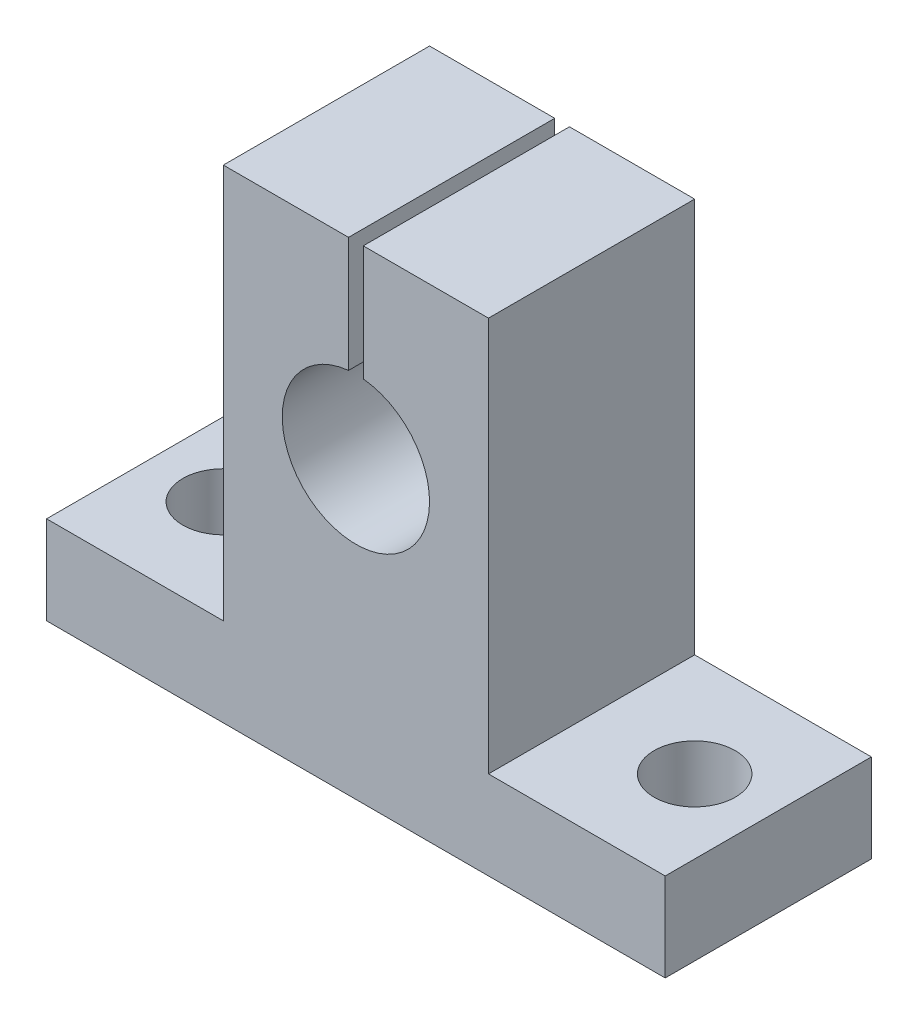
ISO-10303-21;
HEADER;
FILE_DESCRIPTION(('STEP AP214'),'2;1');
FILE_NAME('part.step','',(''),(''),'','','');
FILE_SCHEMA(('AUTOMOTIVE_DESIGN { 1 0 10303 214 1 1 1 1 }'));
ENDSEC;
DATA;
#1=APPLICATION_CONTEXT('core data for automotive mechanical design processes');
#2=APPLICATION_PROTOCOL_DEFINITION('international standard','automotive_design',2000,#1);
#3=PRODUCT_CONTEXT('',#1,'mechanical');
#4=PRODUCT('Part','Part','',(#3));
#5=PRODUCT_RELATED_PRODUCT_CATEGORY('part','',(#4));
#6=PRODUCT_DEFINITION_FORMATION('','',#4);
#7=PRODUCT_DEFINITION_CONTEXT('part definition',#1,'design');
#8=PRODUCT_DEFINITION('design','',#6,#7);
#9=PRODUCT_DEFINITION_SHAPE('','',#8);
#10=(LENGTH_UNIT() NAMED_UNIT(*) SI_UNIT(.MILLI.,.METRE.));
#11=(NAMED_UNIT(*) PLANE_ANGLE_UNIT() SI_UNIT($,.RADIAN.));
#12=(NAMED_UNIT(*) SI_UNIT($,.STERADIAN.) SOLID_ANGLE_UNIT());
#13=UNCERTAINTY_MEASURE_WITH_UNIT(LENGTH_MEASURE(1.E-05),#10,'distance_accuracy_value','');
#14=(GEOMETRIC_REPRESENTATION_CONTEXT(3) GLOBAL_UNCERTAINTY_ASSIGNED_CONTEXT((#13)) GLOBAL_UNIT_ASSIGNED_CONTEXT((#10,
#11,#12)) REPRESENTATION_CONTEXT('',''));
#15=CARTESIAN_POINT('',(0.,0.,0.));
#16=DIRECTION('',(0.,0.,1.));
#17=DIRECTION('',(1.,0.,0.));
#18=AXIS2_PLACEMENT_3D('',#15,#16,#17);
#19=CARTESIAN_POINT('',(9.,12.8,14.));
#20=DIRECTION('',(0.,-1.,0.));
#21=DIRECTION('',(1.,0.,0.));
#22=AXIS2_PLACEMENT_3D('',#19,#20,#21);
#23=PLANE('',#22);
#24=DIRECTION('',(-1.,0.,0.));
#25=VECTOR('',#24,1.);
#26=CARTESIAN_POINT('',(9.,12.8,14.));
#27=LINE('',#26,#25);
#28=CARTESIAN_POINT('',(-0.5,12.8,14.));
#29=VERTEX_POINT('',#28);
#30=CARTESIAN_POINT('',(-9.,12.8,14.));
#31=VERTEX_POINT('',#30);
#32=EDGE_CURVE('E137',#29,#31,#27,.T.);
#33=ORIENTED_EDGE('',*,*,#32,.F.);
#34=DIRECTION('',(0.,0.,-1.));
#35=VECTOR('',#34,1.);
#36=CARTESIAN_POINT('',(-0.5,12.8,14.));
#37=LINE('',#36,#35);
#38=CARTESIAN_POINT('',(-0.5,12.8,0.));
#39=VERTEX_POINT('',#38);
#40=EDGE_CURVE('E123',#29,#39,#37,.T.);
#41=ORIENTED_EDGE('',*,*,#40,.T.);
#42=DIRECTION('',(-1.,0.,0.));
#43=VECTOR('',#42,1.);
#44=CARTESIAN_POINT('',(9.,12.8,0.));
#45=LINE('',#44,#43);
#46=CARTESIAN_POINT('',(-9.,12.8,0.));
#47=VERTEX_POINT('',#46);
#48=EDGE_CURVE('E171',#39,#47,#45,.T.);
#49=ORIENTED_EDGE('',*,*,#48,.T.);
#50=DIRECTION('',(0.,0.,-1.));
#51=VECTOR('',#50,1.);
#52=CARTESIAN_POINT('',(-9.,12.8,14.));
#53=LINE('',#52,#51);
#54=EDGE_CURVE('E146',#31,#47,#53,.T.);
#55=ORIENTED_EDGE('',*,*,#54,.F.);
#56=EDGE_LOOP('',(#33,#41,#49,#55));
#57=FACE_BOUND('',#56,.T.);
#58=ADVANCED_FACE('F37',(#57),#23,.F.);
#59=CARTESIAN_POINT('',(0.,0.,14.));
#60=DIRECTION('',(0.,0.,-1.));
#61=DIRECTION('',(-1.,0.,0.));
#62=AXIS2_PLACEMENT_3D('',#59,#60,#61);
#63=PLANE('',#62);
#64=CARTESIAN_POINT('',(0.,0.,14.));
#65=DIRECTION('',(0.,0.,1.));
#66=DIRECTION('',(1.,0.,0.));
#67=AXIS2_PLACEMENT_3D('',#64,#65,#66);
#68=CIRCLE('',#67,5.);
#69=CARTESIAN_POINT('',(-0.5,4.9749371855331,14.));
#70=VERTEX_POINT('',#69);
#71=CARTESIAN_POINT('',(0.5,4.9749371855331,14.));
#72=VERTEX_POINT('',#71);
#73=EDGE_CURVE('E141',#70,#72,#68,.T.);
#74=ORIENTED_EDGE('',*,*,#73,.F.);
#75=DIRECTION('',(0.,-1.,0.));
#76=VECTOR('',#75,1.);
#77=CARTESIAN_POINT('',(-0.5,-0.67078400819638,14.));
#78=LINE('',#77,#76);
#79=EDGE_CURVE('E59',#29,#70,#78,.T.);
#80=ORIENTED_EDGE('',*,*,#79,.F.);
#81=ORIENTED_EDGE('',*,*,#32,.T.);
#82=DIRECTION('',(0.,-1.,0.));
#83=VECTOR('',#82,1.);
#84=CARTESIAN_POINT('',(-9.,12.8,14.));
#85=LINE('',#84,#83);
#86=CARTESIAN_POINT('',(-9.,-14.,14.));
#87=VERTEX_POINT('',#86);
#88=EDGE_CURVE('E175',#31,#87,#85,.T.);
#89=ORIENTED_EDGE('',*,*,#88,.T.);
#90=DIRECTION('',(-1.,0.,0.));
#91=VECTOR('',#90,1.);
#92=CARTESIAN_POINT('',(-9.,-14.,14.));
#93=LINE('',#92,#91);
#94=CARTESIAN_POINT('',(-21.,-14.,14.));
#95=VERTEX_POINT('',#94);
#96=EDGE_CURVE('E210',#87,#95,#93,.T.);
#97=ORIENTED_EDGE('',*,*,#96,.T.);
#98=DIRECTION('',(0.,-1.,0.));
#99=VECTOR('',#98,1.);
#100=CARTESIAN_POINT('',(-21.,-14.,14.));
#101=LINE('',#100,#99);
#102=CARTESIAN_POINT('',(-21.,-20.,14.));
#103=VERTEX_POINT('',#102);
#104=EDGE_CURVE('E212',#95,#103,#101,.T.);
#105=ORIENTED_EDGE('',*,*,#104,.T.);
#106=DIRECTION('',(1.,0.,0.));
#107=VECTOR('',#106,1.);
#108=CARTESIAN_POINT('',(-21.,-20.,14.));
#109=LINE('',#108,#107);
#110=CARTESIAN_POINT('',(21.,-20.,14.));
#111=VERTEX_POINT('',#110);
#112=EDGE_CURVE('E214',#103,#111,#109,.T.);
#113=ORIENTED_EDGE('',*,*,#112,.T.);
#114=DIRECTION('',(0.,1.,0.));
#115=VECTOR('',#114,1.);
#116=CARTESIAN_POINT('',(21.,-14.,14.));
#117=LINE('',#116,#115);
#118=CARTESIAN_POINT('',(21.,-14.,14.));
#119=VERTEX_POINT('',#118);
#120=EDGE_CURVE('E216',#111,#119,#117,.T.);
#121=ORIENTED_EDGE('',*,*,#120,.T.);
#122=DIRECTION('',(-1.,0.,0.));
#123=VECTOR('',#122,1.);
#124=CARTESIAN_POINT('',(9.,-14.,14.));
#125=LINE('',#124,#123);
#126=CARTESIAN_POINT('',(9.,-14.,14.));
#127=VERTEX_POINT('',#126);
#128=EDGE_CURVE('E152',#119,#127,#125,.T.);
#129=ORIENTED_EDGE('',*,*,#128,.T.);
#130=DIRECTION('',(0.,1.,0.));
#131=VECTOR('',#130,1.);
#132=CARTESIAN_POINT('',(9.,12.8,14.));
#133=LINE('',#132,#131);
#134=CARTESIAN_POINT('',(9.,12.8,14.));
#135=VERTEX_POINT('',#134);
#136=EDGE_CURVE('E149',#127,#135,#133,.T.);
#137=ORIENTED_EDGE('',*,*,#136,.T.);
#138=CARTESIAN_POINT('',(0.5,12.8,14.));
#139=VERTEX_POINT('',#138);
#140=EDGE_CURVE('E148',#135,#139,#27,.T.);
#141=ORIENTED_EDGE('',*,*,#140,.T.);
#142=DIRECTION('',(0.,1.,0.));
#143=VECTOR('',#142,1.);
#144=CARTESIAN_POINT('',(0.5,-0.67078400819638,14.));
#145=LINE('',#144,#143);
#146=EDGE_CURVE('E142',#72,#139,#145,.T.);
#147=ORIENTED_EDGE('',*,*,#146,.F.);
#148=EDGE_LOOP('',(#74,#80,#81,#89,#97,#105,#113,#121,#129,#137,#141,#147));
#149=FACE_BOUND('',#148,.T.);
#150=ADVANCED_FACE('F135',(#149),#63,.F.);
#151=CARTESIAN_POINT('',(0.,0.,0.));
#152=DIRECTION('',(0.,0.,-1.));
#153=DIRECTION('',(-1.,0.,0.));
#154=AXIS2_PLACEMENT_3D('',#151,#152,#153);
#155=PLANE('',#154);
#156=DIRECTION('',(0.,-1.,0.));
#157=VECTOR('',#156,1.);
#158=CARTESIAN_POINT('',(-0.5,-0.67078400819638,0.));
#159=LINE('',#158,#157);
#160=CARTESIAN_POINT('',(-0.5,4.9749371855331,0.));
#161=VERTEX_POINT('',#160);
#162=EDGE_CURVE('E126',#39,#161,#159,.T.);
#163=ORIENTED_EDGE('',*,*,#162,.T.);
#164=CARTESIAN_POINT('',(0.,0.,0.));
#165=DIRECTION('',(0.,0.,1.));
#166=DIRECTION('',(1.,0.,0.));
#167=AXIS2_PLACEMENT_3D('',#164,#165,#166);
#168=CIRCLE('',#167,5.);
#169=CARTESIAN_POINT('',(0.5,4.9749371855331,0.));
#170=VERTEX_POINT('',#169);
#171=EDGE_CURVE('E130',#161,#170,#168,.T.);
#172=ORIENTED_EDGE('',*,*,#171,.T.);
#173=DIRECTION('',(0.,1.,0.));
#174=VECTOR('',#173,1.);
#175=CARTESIAN_POINT('',(0.5,-0.67078400819638,0.));
#176=LINE('',#175,#174);
#177=CARTESIAN_POINT('',(0.5,12.8,0.));
#178=VERTEX_POINT('',#177);
#179=EDGE_CURVE('E52',#170,#178,#176,.T.);
#180=ORIENTED_EDGE('',*,*,#179,.T.);
#181=CARTESIAN_POINT('',(9.,12.8,0.));
#182=VERTEX_POINT('',#181);
#183=EDGE_CURVE('E172',#182,#178,#45,.T.);
#184=ORIENTED_EDGE('',*,*,#183,.F.);
#185=DIRECTION('',(0.,1.,0.));
#186=VECTOR('',#185,1.);
#187=CARTESIAN_POINT('',(9.,12.8,0.));
#188=LINE('',#187,#186);
#189=CARTESIAN_POINT('',(9.,-14.,0.));
#190=VERTEX_POINT('',#189);
#191=EDGE_CURVE('E169',#190,#182,#188,.T.);
#192=ORIENTED_EDGE('',*,*,#191,.F.);
#193=DIRECTION('',(-1.,0.,0.));
#194=VECTOR('',#193,1.);
#195=CARTESIAN_POINT('',(9.,-14.,0.));
#196=LINE('',#195,#194);
#197=CARTESIAN_POINT('',(21.,-14.,0.));
#198=VERTEX_POINT('',#197);
#199=EDGE_CURVE('E167',#198,#190,#196,.T.);
#200=ORIENTED_EDGE('',*,*,#199,.F.);
#201=DIRECTION('',(0.,1.,0.));
#202=VECTOR('',#201,1.);
#203=CARTESIAN_POINT('',(21.,-14.,0.));
#204=LINE('',#203,#202);
#205=CARTESIAN_POINT('',(21.,-20.,0.));
#206=VERTEX_POINT('',#205);
#207=EDGE_CURVE('E165',#206,#198,#204,.T.);
#208=ORIENTED_EDGE('',*,*,#207,.F.);
#209=DIRECTION('',(1.,0.,0.));
#210=VECTOR('',#209,1.);
#211=CARTESIAN_POINT('',(-21.,-20.,0.));
#212=LINE('',#211,#210);
#213=CARTESIAN_POINT('',(-21.,-20.,0.));
#214=VERTEX_POINT('',#213);
#215=EDGE_CURVE('E163',#214,#206,#212,.T.);
#216=ORIENTED_EDGE('',*,*,#215,.F.);
#217=DIRECTION('',(0.,-1.,0.));
#218=VECTOR('',#217,1.);
#219=CARTESIAN_POINT('',(-21.,-14.,0.));
#220=LINE('',#219,#218);
#221=CARTESIAN_POINT('',(-21.,-14.,0.));
#222=VERTEX_POINT('',#221);
#223=EDGE_CURVE('E161',#222,#214,#220,.T.);
#224=ORIENTED_EDGE('',*,*,#223,.F.);
#225=DIRECTION('',(-1.,0.,0.));
#226=VECTOR('',#225,1.);
#227=CARTESIAN_POINT('',(-9.,-14.,0.));
#228=LINE('',#227,#226);
#229=CARTESIAN_POINT('',(-9.,-14.,0.));
#230=VERTEX_POINT('',#229);
#231=EDGE_CURVE('E159',#230,#222,#228,.T.);
#232=ORIENTED_EDGE('',*,*,#231,.F.);
#233=DIRECTION('',(0.,-1.,0.));
#234=VECTOR('',#233,1.);
#235=CARTESIAN_POINT('',(-9.,12.8,0.));
#236=LINE('',#235,#234);
#237=EDGE_CURVE('E156',#47,#230,#236,.T.);
#238=ORIENTED_EDGE('',*,*,#237,.F.);
#239=ORIENTED_EDGE('',*,*,#48,.F.);
#240=EDGE_LOOP('',(#163,#172,#180,#184,#192,#200,#208,#216,#224,#232,#238,#239));
#241=FACE_BOUND('',#240,.T.);
#242=ADVANCED_FACE('F270',(#241),#155,.T.);
#243=CARTESIAN_POINT('',(-9.,12.8,14.));
#244=DIRECTION('',(1.,0.,0.));
#245=DIRECTION('',(0.,1.,0.));
#246=AXIS2_PLACEMENT_3D('',#243,#244,#245);
#247=PLANE('',#246);
#248=ORIENTED_EDGE('',*,*,#237,.T.);
#249=DIRECTION('',(0.,0.,-1.));
#250=VECTOR('',#249,1.);
#251=CARTESIAN_POINT('',(-9.,-14.,14.));
#252=LINE('',#251,#250);
#253=EDGE_CURVE('E195',#87,#230,#252,.T.);
#254=ORIENTED_EDGE('',*,*,#253,.F.);
#255=ORIENTED_EDGE('',*,*,#88,.F.);
#256=ORIENTED_EDGE('',*,*,#54,.T.);
#257=EDGE_LOOP('',(#248,#254,#255,#256));
#258=FACE_BOUND('',#257,.T.);
#259=ADVANCED_FACE('F39',(#258),#247,.F.);
#260=CARTESIAN_POINT('',(-9.,-14.,14.));
#261=DIRECTION('',(0.,-1.,0.));
#262=DIRECTION('',(0.,0.,-1.));
#263=AXIS2_PLACEMENT_3D('',#260,#261,#262);
#264=PLANE('',#263);
#265=CARTESIAN_POINT('',(-16.,-14.,7.));
#266=DIRECTION('',(0.,1.,0.));
#267=DIRECTION('',(0.,0.,1.));
#268=AXIS2_PLACEMENT_3D('',#265,#266,#267);
#269=CIRCLE('',#268,2.75);
#270=CARTESIAN_POINT('',(-16.,-14.,9.75));
#271=VERTEX_POINT('',#270);
#272=EDGE_CURVE('E241',#271,#271,#269,.T.);
#273=ORIENTED_EDGE('',*,*,#272,.F.);
#274=EDGE_LOOP('',(#273));
#275=FACE_BOUND('',#274,.T.);
#276=ORIENTED_EDGE('',*,*,#231,.T.);
#277=DIRECTION('',(0.,0.,-1.));
#278=VECTOR('',#277,1.);
#279=CARTESIAN_POINT('',(-21.,-14.,14.));
#280=LINE('',#279,#278);
#281=EDGE_CURVE('E192',#95,#222,#280,.T.);
#282=ORIENTED_EDGE('',*,*,#281,.F.);
#283=ORIENTED_EDGE('',*,*,#96,.F.);
#284=ORIENTED_EDGE('',*,*,#253,.T.);
#285=EDGE_LOOP('',(#276,#282,#283,#284));
#286=FACE_BOUND('',#285,.T.);
#287=ADVANCED_FACE('F257',(#275,#286),#264,.F.);
#288=CARTESIAN_POINT('',(-21.,-14.,14.));
#289=DIRECTION('',(1.,0.,0.));
#290=DIRECTION('',(0.,0.,-1.));
#291=AXIS2_PLACEMENT_3D('',#288,#289,#290);
#292=PLANE('',#291);
#293=ORIENTED_EDGE('',*,*,#223,.T.);
#294=DIRECTION('',(0.,0.,-1.));
#295=VECTOR('',#294,1.);
#296=CARTESIAN_POINT('',(-21.,-20.,14.));
#297=LINE('',#296,#295);
#298=EDGE_CURVE('E189',#103,#214,#297,.T.);
#299=ORIENTED_EDGE('',*,*,#298,.F.);
#300=ORIENTED_EDGE('',*,*,#104,.F.);
#301=ORIENTED_EDGE('',*,*,#281,.T.);
#302=EDGE_LOOP('',(#293,#299,#300,#301));
#303=FACE_BOUND('',#302,.T.);
#304=ADVANCED_FACE('F260',(#303),#292,.F.);
#305=CARTESIAN_POINT('',(-21.,-20.,14.));
#306=DIRECTION('',(0.,1.,0.));
#307=DIRECTION('',(-1.,0.,0.));
#308=AXIS2_PLACEMENT_3D('',#305,#306,#307);
#309=PLANE('',#308);
#310=CARTESIAN_POINT('',(-16.,-20.,7.));
#311=DIRECTION('',(0.,1.,0.));
#312=DIRECTION('',(0.,0.,1.));
#313=AXIS2_PLACEMENT_3D('',#310,#311,#312);
#314=CIRCLE('',#313,2.75);
#315=CARTESIAN_POINT('',(-16.,-20.,9.75));
#316=VERTEX_POINT('',#315);
#317=EDGE_CURVE('E143',#316,#316,#314,.T.);
#318=ORIENTED_EDGE('',*,*,#317,.T.);
#319=EDGE_LOOP('',(#318));
#320=FACE_BOUND('',#319,.T.);
#321=CARTESIAN_POINT('',(16.,-20.,7.));
#322=DIRECTION('',(0.,1.,0.));
#323=DIRECTION('',(0.,0.,-1.));
#324=AXIS2_PLACEMENT_3D('',#321,#322,#323);
#325=CIRCLE('',#324,2.75);
#326=CARTESIAN_POINT('',(16.,-20.,4.25));
#327=VERTEX_POINT('',#326);
#328=EDGE_CURVE('E238',#327,#327,#325,.T.);
#329=ORIENTED_EDGE('',*,*,#328,.T.);
#330=EDGE_LOOP('',(#329));
#331=FACE_BOUND('',#330,.T.);
#332=ORIENTED_EDGE('',*,*,#215,.T.);
#333=DIRECTION('',(0.,0.,-1.));
#334=VECTOR('',#333,1.);
#335=CARTESIAN_POINT('',(21.,-20.,14.));
#336=LINE('',#335,#334);
#337=EDGE_CURVE('E186',#111,#206,#336,.T.);
#338=ORIENTED_EDGE('',*,*,#337,.F.);
#339=ORIENTED_EDGE('',*,*,#112,.F.);
#340=ORIENTED_EDGE('',*,*,#298,.T.);
#341=EDGE_LOOP('',(#332,#338,#339,#340));
#342=FACE_BOUND('',#341,.T.);
#343=ADVANCED_FACE('F247',(#320,#331,#342),#309,.F.);
#344=CARTESIAN_POINT('',(21.,-14.,14.));
#345=DIRECTION('',(-1.,0.,0.));
#346=DIRECTION('',(0.,-1.,0.));
#347=AXIS2_PLACEMENT_3D('',#344,#345,#346);
#348=PLANE('',#347);
#349=ORIENTED_EDGE('',*,*,#207,.T.);
#350=DIRECTION('',(0.,0.,-1.));
#351=VECTOR('',#350,1.);
#352=CARTESIAN_POINT('',(21.,-14.,14.));
#353=LINE('',#352,#351);
#354=EDGE_CURVE('E183',#119,#198,#353,.T.);
#355=ORIENTED_EDGE('',*,*,#354,.F.);
#356=ORIENTED_EDGE('',*,*,#120,.F.);
#357=ORIENTED_EDGE('',*,*,#337,.T.);
#358=EDGE_LOOP('',(#349,#355,#356,#357));
#359=FACE_BOUND('',#358,.T.);
#360=ADVANCED_FACE('F276',(#359),#348,.F.);
#361=CARTESIAN_POINT('',(9.,-14.,14.));
#362=DIRECTION('',(0.,-1.,0.));
#363=DIRECTION('',(1.,0.,0.));
#364=AXIS2_PLACEMENT_3D('',#361,#362,#363);
#365=PLANE('',#364);
#366=CARTESIAN_POINT('',(16.,-14.,7.));
#367=DIRECTION('',(0.,1.,0.));
#368=DIRECTION('',(0.,0.,-1.));
#369=AXIS2_PLACEMENT_3D('',#366,#367,#368);
#370=CIRCLE('',#369,2.75);
#371=CARTESIAN_POINT('',(16.,-14.,4.25));
#372=VERTEX_POINT('',#371);
#373=EDGE_CURVE('E235',#372,#372,#370,.T.);
#374=ORIENTED_EDGE('',*,*,#373,.F.);
#375=EDGE_LOOP('',(#374));
#376=FACE_BOUND('',#375,.T.);
#377=ORIENTED_EDGE('',*,*,#199,.T.);
#378=DIRECTION('',(0.,0.,-1.));
#379=VECTOR('',#378,1.);
#380=CARTESIAN_POINT('',(9.,-14.,14.));
#381=LINE('',#380,#379);
#382=EDGE_CURVE('E180',#127,#190,#381,.T.);
#383=ORIENTED_EDGE('',*,*,#382,.F.);
#384=ORIENTED_EDGE('',*,*,#128,.F.);
#385=ORIENTED_EDGE('',*,*,#354,.T.);
#386=EDGE_LOOP('',(#377,#383,#384,#385));
#387=FACE_BOUND('',#386,.T.);
#388=ADVANCED_FACE('F224',(#376,#387),#365,.F.);
#389=CARTESIAN_POINT('',(9.,12.8,14.));
#390=DIRECTION('',(-1.,0.,0.));
#391=DIRECTION('',(0.,-1.,0.));
#392=AXIS2_PLACEMENT_3D('',#389,#390,#391);
#393=PLANE('',#392);
#394=ORIENTED_EDGE('',*,*,#191,.T.);
#395=DIRECTION('',(0.,0.,-1.));
#396=VECTOR('',#395,1.);
#397=CARTESIAN_POINT('',(9.,12.8,14.));
#398=LINE('',#397,#396);
#399=EDGE_CURVE('E177',#135,#182,#398,.T.);
#400=ORIENTED_EDGE('',*,*,#399,.F.);
#401=ORIENTED_EDGE('',*,*,#136,.F.);
#402=ORIENTED_EDGE('',*,*,#382,.T.);
#403=EDGE_LOOP('',(#394,#400,#401,#402));
#404=FACE_BOUND('',#403,.T.);
#405=ADVANCED_FACE('F228',(#404),#393,.F.);
#406=ORIENTED_EDGE('',*,*,#183,.T.);
#407=DIRECTION('',(0.,0.,1.));
#408=VECTOR('',#407,1.);
#409=CARTESIAN_POINT('',(0.5,12.8,14.));
#410=LINE('',#409,#408);
#411=EDGE_CURVE('E131',#178,#139,#410,.T.);
#412=ORIENTED_EDGE('',*,*,#411,.T.);
#413=ORIENTED_EDGE('',*,*,#140,.F.);
#414=ORIENTED_EDGE('',*,*,#399,.T.);
#415=EDGE_LOOP('',(#406,#412,#413,#414));
#416=FACE_BOUND('',#415,.T.);
#417=ADVANCED_FACE('F231',(#416),#23,.F.);
#418=CARTESIAN_POINT('',(0.,0.,14.));
#419=DIRECTION('',(0.,0.,-1.));
#420=DIRECTION('',(-1.,0.,0.));
#421=AXIS2_PLACEMENT_3D('',#418,#419,#420);
#422=CYLINDRICAL_SURFACE('',#421,5.);
#423=DIRECTION('',(0.,0.,-1.));
#424=VECTOR('',#423,1.);
#425=CARTESIAN_POINT('',(-0.5,4.9749371855331,14.));
#426=LINE('',#425,#424);
#427=EDGE_CURVE('E11',#70,#161,#426,.T.);
#428=ORIENTED_EDGE('',*,*,#427,.F.);
#429=ORIENTED_EDGE('',*,*,#73,.T.);
#430=DIRECTION('',(0.,0.,-1.));
#431=VECTOR('',#430,1.);
#432=CARTESIAN_POINT('',(0.5,4.9749371855331,14.));
#433=LINE('',#432,#431);
#434=EDGE_CURVE('E45',#170,#72,#433,.F.);
#435=ORIENTED_EDGE('',*,*,#434,.F.);
#436=ORIENTED_EDGE('',*,*,#171,.F.);
#437=EDGE_LOOP('',(#428,#429,#435,#436));
#438=FACE_BOUND('',#437,.T.);
#439=ADVANCED_FACE('F204',(#438),#422,.F.);
#440=CARTESIAN_POINT('',(0.5,-0.67078400819638,0.));
#441=DIRECTION('',(1.,0.,0.));
#442=DIRECTION('',(0.,0.,-1.));
#443=AXIS2_PLACEMENT_3D('',#440,#441,#442);
#444=PLANE('',#443);
#445=ORIENTED_EDGE('',*,*,#179,.F.);
#446=ORIENTED_EDGE('',*,*,#434,.T.);
#447=ORIENTED_EDGE('',*,*,#146,.T.);
#448=ORIENTED_EDGE('',*,*,#411,.F.);
#449=EDGE_LOOP('',(#445,#446,#447,#448));
#450=FACE_BOUND('',#449,.T.);
#451=ADVANCED_FACE('F197',(#450),#444,.F.);
#452=CARTESIAN_POINT('',(-0.5,-0.67078400819638,0.));
#453=DIRECTION('',(-1.,0.,0.));
#454=DIRECTION('',(0.,0.,1.));
#455=AXIS2_PLACEMENT_3D('',#452,#453,#454);
#456=PLANE('',#455);
#457=ORIENTED_EDGE('',*,*,#79,.T.);
#458=ORIENTED_EDGE('',*,*,#427,.T.);
#459=ORIENTED_EDGE('',*,*,#162,.F.);
#460=ORIENTED_EDGE('',*,*,#40,.F.);
#461=EDGE_LOOP('',(#457,#458,#459,#460));
#462=FACE_BOUND('',#461,.T.);
#463=ADVANCED_FACE('F124',(#462),#456,.F.);
#464=CARTESIAN_POINT('',(16.,-20.,7.));
#465=DIRECTION('',(0.,1.,0.));
#466=DIRECTION('',(0.,0.,1.));
#467=AXIS2_PLACEMENT_3D('',#464,#465,#466);
#468=CYLINDRICAL_SURFACE('',#467,2.75);
#469=ORIENTED_EDGE('',*,*,#328,.F.);
#470=EDGE_LOOP('',(#469));
#471=FACE_BOUND('',#470,.T.);
#472=ORIENTED_EDGE('',*,*,#373,.T.);
#473=EDGE_LOOP('',(#472));
#474=FACE_BOUND('',#473,.T.);
#475=ADVANCED_FACE('F253',(#471,#474),#468,.F.);
#476=CARTESIAN_POINT('',(-16.,-20.,7.));
#477=DIRECTION('',(0.,1.,0.));
#478=DIRECTION('',(0.,0.,1.));
#479=AXIS2_PLACEMENT_3D('',#476,#477,#478);
#480=CYLINDRICAL_SURFACE('',#479,2.75);
#481=ORIENTED_EDGE('',*,*,#317,.F.);
#482=EDGE_LOOP('',(#481));
#483=FACE_BOUND('',#482,.T.);
#484=ORIENTED_EDGE('',*,*,#272,.T.);
#485=EDGE_LOOP('',(#484));
#486=FACE_BOUND('',#485,.T.);
#487=ADVANCED_FACE('F250',(#483,#486),#480,.F.);
#488=CLOSED_SHELL('',(#58,#150,#242,#259,#287,#304,#343,#360,#388,#405,#417,#439,#451,#463,#475,#487));
#489=MANIFOLD_SOLID_BREP('B2',#488);
#490=ADVANCED_BREP_SHAPE_REPRESENTATION('',(#18,#489),#14);
#491=SHAPE_DEFINITION_REPRESENTATION(#9,#490);
ENDSEC;
END-ISO-10303-21;
